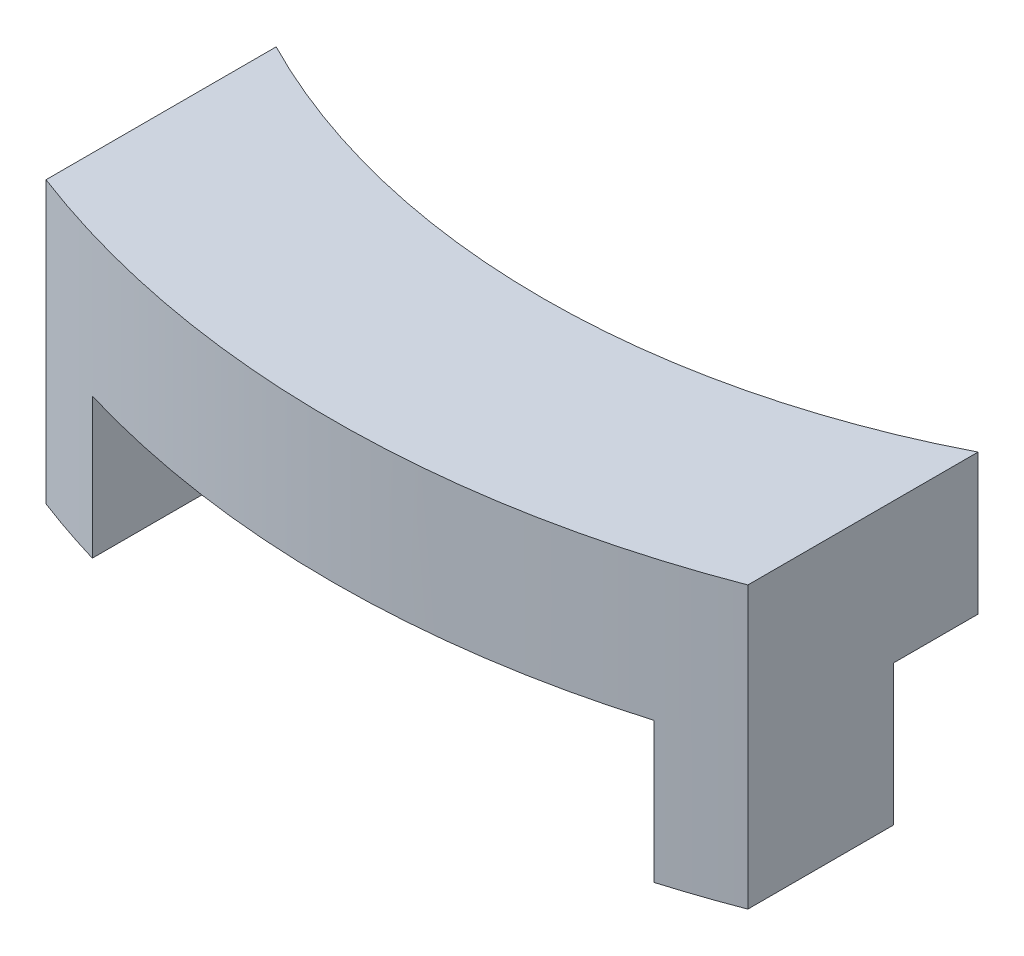
ISO-10303-21;
HEADER;
FILE_DESCRIPTION(('STEP AP214'),'2;1');
FILE_NAME('part.step','',(''),(''),'','','');
FILE_SCHEMA(('AUTOMOTIVE_DESIGN { 1 0 10303 214 1 1 1 1 }'));
ENDSEC;
DATA;
#1=APPLICATION_CONTEXT('core data for automotive mechanical design processes');
#2=APPLICATION_PROTOCOL_DEFINITION('international standard','automotive_design',2000,#1);
#3=PRODUCT_CONTEXT('',#1,'mechanical');
#4=PRODUCT('Part','Part','',(#3));
#5=PRODUCT_RELATED_PRODUCT_CATEGORY('part','',(#4));
#6=PRODUCT_DEFINITION_FORMATION('','',#4);
#7=PRODUCT_DEFINITION_CONTEXT('part definition',#1,'design');
#8=PRODUCT_DEFINITION('design','',#6,#7);
#9=PRODUCT_DEFINITION_SHAPE('','',#8);
#10=(LENGTH_UNIT() NAMED_UNIT(*) SI_UNIT(.MILLI.,.METRE.));
#11=(NAMED_UNIT(*) PLANE_ANGLE_UNIT() SI_UNIT($,.RADIAN.));
#12=(NAMED_UNIT(*) SI_UNIT($,.STERADIAN.) SOLID_ANGLE_UNIT());
#13=UNCERTAINTY_MEASURE_WITH_UNIT(LENGTH_MEASURE(1.E-05),#10,'distance_accuracy_value','');
#14=(GEOMETRIC_REPRESENTATION_CONTEXT(3) GLOBAL_UNCERTAINTY_ASSIGNED_CONTEXT((#13)) GLOBAL_UNIT_ASSIGNED_CONTEXT((#10,
#11,#12)) REPRESENTATION_CONTEXT('',''));
#15=CARTESIAN_POINT('',(0.,0.,0.));
#16=DIRECTION('',(0.,0.,1.));
#17=DIRECTION('',(1.,0.,0.));
#18=AXIS2_PLACEMENT_3D('',#15,#16,#17);
#19=CARTESIAN_POINT('',(0.,0.,0.));
#20=DIRECTION('',(0.,1.,0.));
#21=DIRECTION('',(0.,0.,1.));
#22=AXIS2_PLACEMENT_3D('',#19,#20,#21);
#23=PLANE('',#22);
#24=DIRECTION('',(1.,0.,0.));
#25=VECTOR('',#24,1.);
#26=CARTESIAN_POINT('',(4.,0.,11.));
#27=LINE('',#26,#25);
#28=CARTESIAN_POINT('',(4.,0.,11.));
#29=VERTEX_POINT('',#28);
#30=CARTESIAN_POINT('',(5.,0.,11.));
#31=VERTEX_POINT('',#30);
#32=EDGE_CURVE('E48',#29,#31,#27,.T.);
#33=ORIENTED_EDGE('',*,*,#32,.F.);
#34=DIRECTION('',(0.,0.,-1.));
#35=VECTOR('',#34,1.);
#36=CARTESIAN_POINT('',(4.,0.,13.4164078649987));
#37=LINE('',#36,#35);
#38=CARTESIAN_POINT('',(4.,0.,13.4164078649987));
#39=VERTEX_POINT('',#38);
#40=EDGE_CURVE('E129',#39,#29,#37,.T.);
#41=ORIENTED_EDGE('',*,*,#40,.F.);
#42=CARTESIAN_POINT('',(0.,0.,0.));
#43=DIRECTION('',(0.,1.,0.));
#44=DIRECTION('',(0.,0.,1.));
#45=AXIS2_PLACEMENT_3D('',#42,#43,#44);
#46=CIRCLE('',#45,14.);
#47=CARTESIAN_POINT('',(-4.,0.,13.4164078649987));
#48=VERTEX_POINT('',#47);
#49=EDGE_CURVE('E176',#48,#39,#46,.T.);
#50=ORIENTED_EDGE('',*,*,#49,.F.);
#51=DIRECTION('',(0.,0.,1.));
#52=VECTOR('',#51,1.);
#53=CARTESIAN_POINT('',(-4.,0.,13.4164078649987));
#54=LINE('',#53,#52);
#55=CARTESIAN_POINT('',(-4.,0.,11.));
#56=VERTEX_POINT('',#55);
#57=EDGE_CURVE('E134',#56,#48,#54,.T.);
#58=ORIENTED_EDGE('',*,*,#57,.F.);
#59=DIRECTION('',(1.,0.,0.));
#60=VECTOR('',#59,1.);
#61=CARTESIAN_POINT('',(-5.,0.,11.));
#62=LINE('',#61,#60);
#63=CARTESIAN_POINT('',(-5.,0.,11.));
#64=VERTEX_POINT('',#63);
#65=EDGE_CURVE('E56',#64,#56,#62,.T.);
#66=ORIENTED_EDGE('',*,*,#65,.F.);
#67=DIRECTION('',(0.,0.,1.));
#68=VECTOR('',#67,1.);
#69=CARTESIAN_POINT('',(-5.,0.,9.79795897113271));
#70=LINE('',#69,#68);
#71=CARTESIAN_POINT('',(-5.,0.,9.79795897113271));
#72=VERTEX_POINT('',#71);
#73=EDGE_CURVE('E174',#72,#64,#70,.T.);
#74=ORIENTED_EDGE('',*,*,#73,.F.);
#75=CARTESIAN_POINT('',(0.,0.,0.));
#76=DIRECTION('',(0.,-1.,0.));
#77=DIRECTION('',(0.,0.,1.));
#78=AXIS2_PLACEMENT_3D('',#75,#76,#77);
#79=CIRCLE('',#78,11.);
#80=CARTESIAN_POINT('',(5.,0.,9.79795897113271));
#81=VERTEX_POINT('',#80);
#82=EDGE_CURVE('E160',#81,#72,#79,.T.);
#83=ORIENTED_EDGE('',*,*,#82,.F.);
#84=DIRECTION('',(0.,0.,-1.));
#85=VECTOR('',#84,1.);
#86=CARTESIAN_POINT('',(5.,0.,9.79795897113271));
#87=LINE('',#86,#85);
#88=EDGE_CURVE('E165',#31,#81,#87,.T.);
#89=ORIENTED_EDGE('',*,*,#88,.F.);
#90=EDGE_LOOP('',(#33,#41,#50,#58,#66,#74,#83,#89));
#91=FACE_BOUND('',#90,.T.);
#92=ADVANCED_FACE('F33',(#91),#23,.F.);
#93=CARTESIAN_POINT('',(0.,2.,0.));
#94=DIRECTION('',(0.,-1.,0.));
#95=DIRECTION('',(0.,0.,-1.));
#96=AXIS2_PLACEMENT_3D('',#93,#94,#95);
#97=CYLINDRICAL_SURFACE('',#96,11.);
#98=ORIENTED_EDGE('',*,*,#82,.T.);
#99=DIRECTION('',(0.,-1.,0.));
#100=VECTOR('',#99,1.);
#101=CARTESIAN_POINT('',(-5.,2.,9.79795897113271));
#102=LINE('',#101,#100);
#103=CARTESIAN_POINT('',(-5.,2.,9.79795897113271));
#104=VERTEX_POINT('',#103);
#105=EDGE_CURVE('E11',#104,#72,#102,.T.);
#106=ORIENTED_EDGE('',*,*,#105,.F.);
#107=CARTESIAN_POINT('',(0.,2.,0.));
#108=DIRECTION('',(0.,-1.,0.));
#109=DIRECTION('',(0.,0.,1.));
#110=AXIS2_PLACEMENT_3D('',#107,#108,#109);
#111=CIRCLE('',#110,11.);
#112=CARTESIAN_POINT('',(5.,2.,9.79795897113271));
#113=VERTEX_POINT('',#112);
#114=EDGE_CURVE('E161',#113,#104,#111,.T.);
#115=ORIENTED_EDGE('',*,*,#114,.F.);
#116=DIRECTION('',(0.,-1.,0.));
#117=VECTOR('',#116,1.);
#118=CARTESIAN_POINT('',(5.,2.,9.79795897113271));
#119=LINE('',#118,#117);
#120=EDGE_CURVE('E171',#113,#81,#119,.T.);
#121=ORIENTED_EDGE('',*,*,#120,.T.);
#122=EDGE_LOOP('',(#98,#106,#115,#121));
#123=FACE_BOUND('',#122,.T.);
#124=ADVANCED_FACE('F35',(#123),#97,.F.);
#125=CARTESIAN_POINT('',(-5.,2.,9.79795897113271));
#126=DIRECTION('',(1.,0.,0.));
#127=DIRECTION('',(0.,0.,-1.));
#128=AXIS2_PLACEMENT_3D('',#125,#126,#127);
#129=PLANE('',#128);
#130=ORIENTED_EDGE('',*,*,#73,.T.);
#131=DIRECTION('',(0.,1.,0.));
#132=VECTOR('',#131,1.);
#133=CARTESIAN_POINT('',(-5.,-2.,11.));
#134=LINE('',#133,#132);
#135=CARTESIAN_POINT('',(-5.,-2.,11.));
#136=VERTEX_POINT('',#135);
#137=EDGE_CURVE('E157',#136,#64,#134,.T.);
#138=ORIENTED_EDGE('',*,*,#137,.F.);
#139=DIRECTION('',(0.,0.,-1.));
#140=VECTOR('',#139,1.);
#141=CARTESIAN_POINT('',(-5.,-2.,11.));
#142=LINE('',#141,#140);
#143=CARTESIAN_POINT('',(-5.,-2.,13.076696830622));
#144=VERTEX_POINT('',#143);
#145=EDGE_CURVE('E143',#144,#136,#142,.T.);
#146=ORIENTED_EDGE('',*,*,#145,.F.);
#147=DIRECTION('',(0.,-1.,0.));
#148=VECTOR('',#147,1.);
#149=CARTESIAN_POINT('',(-5.,2.,13.076696830622));
#150=LINE('',#149,#148);
#151=CARTESIAN_POINT('',(-5.,2.,13.076696830622));
#152=VERTEX_POINT('',#151);
#153=EDGE_CURVE('E41',#152,#144,#150,.T.);
#154=ORIENTED_EDGE('',*,*,#153,.F.);
#155=DIRECTION('',(0.,0.,1.));
#156=VECTOR('',#155,1.);
#157=CARTESIAN_POINT('',(-5.,2.,9.79795897113271));
#158=LINE('',#157,#156);
#159=EDGE_CURVE('E164',#104,#152,#158,.T.);
#160=ORIENTED_EDGE('',*,*,#159,.F.);
#161=ORIENTED_EDGE('',*,*,#105,.T.);
#162=EDGE_LOOP('',(#130,#138,#146,#154,#160,#161));
#163=FACE_BOUND('',#162,.T.);
#164=ADVANCED_FACE('F190',(#163),#129,.F.);
#165=CARTESIAN_POINT('',(0.,2.,0.));
#166=DIRECTION('',(0.,-1.,0.));
#167=DIRECTION('',(0.,0.,-1.));
#168=AXIS2_PLACEMENT_3D('',#165,#166,#167);
#169=CYLINDRICAL_SURFACE('',#168,14.);
#170=ORIENTED_EDGE('',*,*,#153,.T.);
#171=CARTESIAN_POINT('',(0.,-2.,0.));
#172=DIRECTION('',(0.,-1.,0.));
#173=DIRECTION('',(0.,0.,-1.));
#174=AXIS2_PLACEMENT_3D('',#171,#172,#173);
#175=CIRCLE('',#174,14.);
#176=CARTESIAN_POINT('',(-4.,-2.,13.4164078649987));
#177=VERTEX_POINT('',#176);
#178=EDGE_CURVE('E140',#177,#144,#175,.T.);
#179=ORIENTED_EDGE('',*,*,#178,.F.);
#180=DIRECTION('',(0.,1.,0.));
#181=VECTOR('',#180,1.);
#182=CARTESIAN_POINT('',(-4.,-2.,13.4164078649987));
#183=LINE('',#182,#181);
#184=EDGE_CURVE('E148',#177,#48,#183,.T.);
#185=ORIENTED_EDGE('',*,*,#184,.T.);
#186=ORIENTED_EDGE('',*,*,#49,.T.);
#187=DIRECTION('',(0.,1.,0.));
#188=VECTOR('',#187,1.);
#189=CARTESIAN_POINT('',(4.,-2.,13.4164078649987));
#190=LINE('',#189,#188);
#191=CARTESIAN_POINT('',(4.,-2.,13.4164078649987));
#192=VERTEX_POINT('',#191);
#193=EDGE_CURVE('E132',#192,#39,#190,.T.);
#194=ORIENTED_EDGE('',*,*,#193,.F.);
#195=CARTESIAN_POINT('',(0.,-2.,0.));
#196=DIRECTION('',(0.,-1.,0.));
#197=DIRECTION('',(0.,0.,-1.));
#198=AXIS2_PLACEMENT_3D('',#195,#196,#197);
#199=CIRCLE('',#198,14.);
#200=CARTESIAN_POINT('',(5.,-2.,13.076696830622));
#201=VERTEX_POINT('',#200);
#202=EDGE_CURVE('E121',#201,#192,#199,.T.);
#203=ORIENTED_EDGE('',*,*,#202,.F.);
#204=DIRECTION('',(0.,-1.,0.));
#205=VECTOR('',#204,1.);
#206=CARTESIAN_POINT('',(5.,2.,13.076696830622));
#207=LINE('',#206,#205);
#208=CARTESIAN_POINT('',(5.,2.,13.076696830622));
#209=VERTEX_POINT('',#208);
#210=EDGE_CURVE('E118',#209,#201,#207,.T.);
#211=ORIENTED_EDGE('',*,*,#210,.F.);
#212=CARTESIAN_POINT('',(0.,2.,0.));
#213=DIRECTION('',(0.,1.,0.));
#214=DIRECTION('',(0.,0.,1.));
#215=AXIS2_PLACEMENT_3D('',#212,#213,#214);
#216=CIRCLE('',#215,14.);
#217=EDGE_CURVE('E167',#152,#209,#216,.T.);
#218=ORIENTED_EDGE('',*,*,#217,.F.);
#219=EDGE_LOOP('',(#170,#179,#185,#186,#194,#203,#211,#218));
#220=FACE_BOUND('',#219,.T.);
#221=ADVANCED_FACE('F187',(#220),#169,.T.);
#222=CARTESIAN_POINT('',(5.,2.,9.79795897113271));
#223=DIRECTION('',(-1.,0.,0.));
#224=DIRECTION('',(0.,0.,1.));
#225=AXIS2_PLACEMENT_3D('',#222,#223,#224);
#226=PLANE('',#225);
#227=ORIENTED_EDGE('',*,*,#210,.T.);
#228=DIRECTION('',(0.,0.,1.));
#229=VECTOR('',#228,1.);
#230=CARTESIAN_POINT('',(5.,-2.,13.076696830622));
#231=LINE('',#230,#229);
#232=CARTESIAN_POINT('',(5.,-2.,11.));
#233=VERTEX_POINT('',#232);
#234=EDGE_CURVE('E111',#233,#201,#231,.T.);
#235=ORIENTED_EDGE('',*,*,#234,.F.);
#236=DIRECTION('',(0.,1.,0.));
#237=VECTOR('',#236,1.);
#238=CARTESIAN_POINT('',(5.,-2.,11.));
#239=LINE('',#238,#237);
#240=EDGE_CURVE('E114',#233,#31,#239,.T.);
#241=ORIENTED_EDGE('',*,*,#240,.T.);
#242=ORIENTED_EDGE('',*,*,#88,.T.);
#243=ORIENTED_EDGE('',*,*,#120,.F.);
#244=DIRECTION('',(0.,0.,-1.));
#245=VECTOR('',#244,1.);
#246=CARTESIAN_POINT('',(5.,2.,9.79795897113271));
#247=LINE('',#246,#245);
#248=EDGE_CURVE('E169',#209,#113,#247,.T.);
#249=ORIENTED_EDGE('',*,*,#248,.F.);
#250=EDGE_LOOP('',(#227,#235,#241,#242,#243,#249));
#251=FACE_BOUND('',#250,.T.);
#252=ADVANCED_FACE('F113',(#251),#226,.F.);
#253=CARTESIAN_POINT('',(0.,2.,0.));
#254=DIRECTION('',(0.,1.,0.));
#255=DIRECTION('',(0.,0.,1.));
#256=AXIS2_PLACEMENT_3D('',#253,#254,#255);
#257=PLANE('',#256);
#258=ORIENTED_EDGE('',*,*,#114,.T.);
#259=ORIENTED_EDGE('',*,*,#159,.T.);
#260=ORIENTED_EDGE('',*,*,#217,.T.);
#261=ORIENTED_EDGE('',*,*,#248,.T.);
#262=EDGE_LOOP('',(#258,#259,#260,#261));
#263=FACE_BOUND('',#262,.T.);
#264=ADVANCED_FACE('F209',(#263),#257,.T.);
#265=CARTESIAN_POINT('',(-5.,-2.,11.));
#266=DIRECTION('',(0.,0.,1.));
#267=DIRECTION('',(1.,0.,0.));
#268=AXIS2_PLACEMENT_3D('',#265,#266,#267);
#269=PLANE('',#268);
#270=ORIENTED_EDGE('',*,*,#65,.T.);
#271=DIRECTION('',(0.,1.,0.));
#272=VECTOR('',#271,1.);
#273=CARTESIAN_POINT('',(-4.,-2.,11.));
#274=LINE('',#273,#272);
#275=CARTESIAN_POINT('',(-4.,-2.,11.));
#276=VERTEX_POINT('',#275);
#277=EDGE_CURVE('E154',#276,#56,#274,.T.);
#278=ORIENTED_EDGE('',*,*,#277,.F.);
#279=DIRECTION('',(1.,0.,0.));
#280=VECTOR('',#279,1.);
#281=CARTESIAN_POINT('',(-5.,-2.,11.));
#282=LINE('',#281,#280);
#283=EDGE_CURVE('E145',#136,#276,#282,.T.);
#284=ORIENTED_EDGE('',*,*,#283,.F.);
#285=ORIENTED_EDGE('',*,*,#137,.T.);
#286=EDGE_LOOP('',(#270,#278,#284,#285));
#287=FACE_BOUND('',#286,.T.);
#288=ADVANCED_FACE('F242',(#287),#269,.F.);
#289=CARTESIAN_POINT('',(-4.,-2.,13.4164078649987));
#290=DIRECTION('',(-1.,0.,0.));
#291=DIRECTION('',(0.,0.,1.));
#292=AXIS2_PLACEMENT_3D('',#289,#290,#291);
#293=PLANE('',#292);
#294=ORIENTED_EDGE('',*,*,#57,.T.);
#295=ORIENTED_EDGE('',*,*,#184,.F.);
#296=DIRECTION('',(0.,0.,1.));
#297=VECTOR('',#296,1.);
#298=CARTESIAN_POINT('',(-4.,-2.,13.4164078649987));
#299=LINE('',#298,#297);
#300=EDGE_CURVE('E147',#276,#177,#299,.T.);
#301=ORIENTED_EDGE('',*,*,#300,.F.);
#302=ORIENTED_EDGE('',*,*,#277,.T.);
#303=EDGE_LOOP('',(#294,#295,#301,#302));
#304=FACE_BOUND('',#303,.T.);
#305=ADVANCED_FACE('F198',(#304),#293,.F.);
#306=CARTESIAN_POINT('',(0.,-2.,0.));
#307=DIRECTION('',(0.,-1.,0.));
#308=DIRECTION('',(0.,0.,-1.));
#309=AXIS2_PLACEMENT_3D('',#306,#307,#308);
#310=PLANE('',#309);
#311=ORIENTED_EDGE('',*,*,#178,.T.);
#312=ORIENTED_EDGE('',*,*,#145,.T.);
#313=ORIENTED_EDGE('',*,*,#283,.T.);
#314=ORIENTED_EDGE('',*,*,#300,.T.);
#315=EDGE_LOOP('',(#311,#312,#313,#314));
#316=FACE_BOUND('',#315,.T.);
#317=ADVANCED_FACE('F193',(#316),#310,.T.);
#318=CARTESIAN_POINT('',(4.,-2.,11.));
#319=DIRECTION('',(0.,0.,1.));
#320=DIRECTION('',(1.,0.,0.));
#321=AXIS2_PLACEMENT_3D('',#318,#319,#320);
#322=PLANE('',#321);
#323=ORIENTED_EDGE('',*,*,#32,.T.);
#324=ORIENTED_EDGE('',*,*,#240,.F.);
#325=DIRECTION('',(1.,0.,0.));
#326=VECTOR('',#325,1.);
#327=CARTESIAN_POINT('',(4.,-2.,11.));
#328=LINE('',#327,#326);
#329=CARTESIAN_POINT('',(4.,-2.,11.));
#330=VERTEX_POINT('',#329);
#331=EDGE_CURVE('E122',#330,#233,#328,.T.);
#332=ORIENTED_EDGE('',*,*,#331,.F.);
#333=DIRECTION('',(0.,1.,0.));
#334=VECTOR('',#333,1.);
#335=CARTESIAN_POINT('',(4.,-2.,11.));
#336=LINE('',#335,#334);
#337=EDGE_CURVE('E136',#330,#29,#336,.T.);
#338=ORIENTED_EDGE('',*,*,#337,.T.);
#339=EDGE_LOOP('',(#323,#324,#332,#338));
#340=FACE_BOUND('',#339,.T.);
#341=ADVANCED_FACE('F131',(#340),#322,.F.);
#342=CARTESIAN_POINT('',(4.,-2.,13.4164078649987));
#343=DIRECTION('',(1.,0.,0.));
#344=DIRECTION('',(0.,0.,-1.));
#345=AXIS2_PLACEMENT_3D('',#342,#343,#344);
#346=PLANE('',#345);
#347=ORIENTED_EDGE('',*,*,#40,.T.);
#348=ORIENTED_EDGE('',*,*,#337,.F.);
#349=DIRECTION('',(0.,0.,-1.));
#350=VECTOR('',#349,1.);
#351=CARTESIAN_POINT('',(4.,-2.,13.4164078649987));
#352=LINE('',#351,#350);
#353=EDGE_CURVE('E127',#192,#330,#352,.T.);
#354=ORIENTED_EDGE('',*,*,#353,.F.);
#355=ORIENTED_EDGE('',*,*,#193,.T.);
#356=EDGE_LOOP('',(#347,#348,#354,#355));
#357=FACE_BOUND('',#356,.T.);
#358=ADVANCED_FACE('F265',(#357),#346,.F.);
#359=CARTESIAN_POINT('',(0.,-2.,0.));
#360=DIRECTION('',(0.,-1.,0.));
#361=DIRECTION('',(0.,0.,-1.));
#362=AXIS2_PLACEMENT_3D('',#359,#360,#361);
#363=PLANE('',#362);
#364=ORIENTED_EDGE('',*,*,#331,.T.);
#365=ORIENTED_EDGE('',*,*,#234,.T.);
#366=ORIENTED_EDGE('',*,*,#202,.T.);
#367=ORIENTED_EDGE('',*,*,#353,.T.);
#368=EDGE_LOOP('',(#364,#365,#366,#367));
#369=FACE_BOUND('',#368,.T.);
#370=ADVANCED_FACE('F125',(#369),#363,.T.);
#371=CLOSED_SHELL('',(#92,#124,#164,#221,#252,#264,#288,#305,#317,#341,#358,#370));
#372=MANIFOLD_SOLID_BREP('B2',#371);
#373=ADVANCED_BREP_SHAPE_REPRESENTATION('',(#18,#372),#14);
#374=SHAPE_DEFINITION_REPRESENTATION(#9,#373);
ENDSEC;
END-ISO-10303-21;
